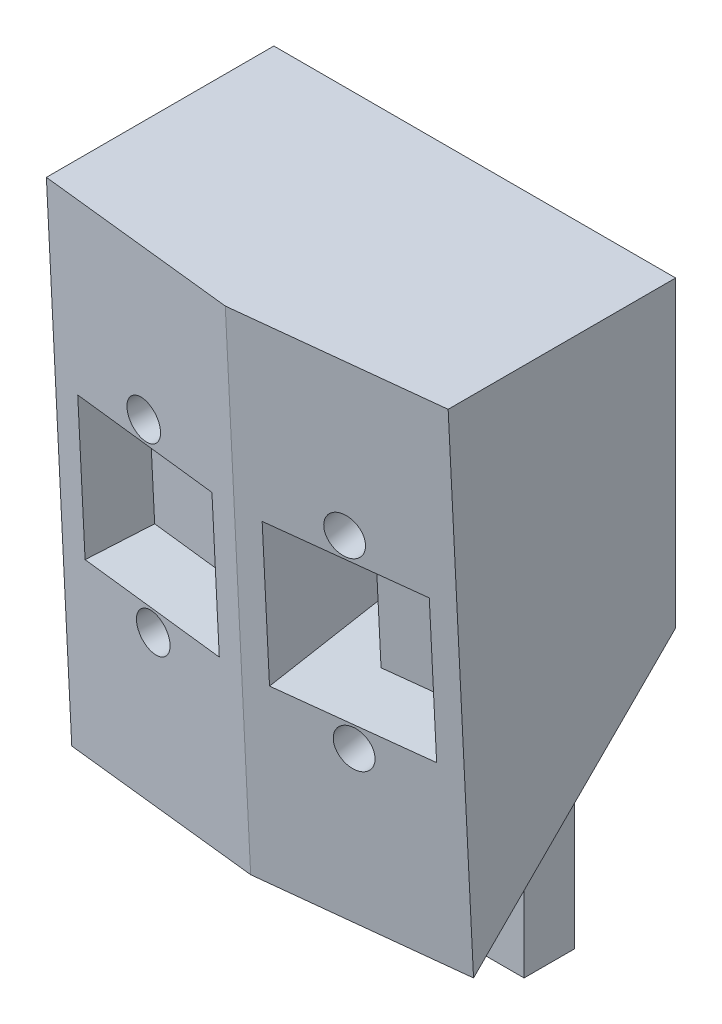
ISO-10303-21;
HEADER;
FILE_DESCRIPTION(('STEP AP214'),'2;1');
FILE_NAME('part.step','',(''),(''),'','','');
FILE_SCHEMA(('AUTOMOTIVE_DESIGN { 1 0 10303 214 1 1 1 1 }'));
ENDSEC;
DATA;
#1=APPLICATION_CONTEXT('core data for automotive mechanical design processes');
#2=APPLICATION_PROTOCOL_DEFINITION('international standard','automotive_design',2000,#1);
#3=PRODUCT_CONTEXT('',#1,'mechanical');
#4=PRODUCT('Part','Part','',(#3));
#5=PRODUCT_RELATED_PRODUCT_CATEGORY('part','',(#4));
#6=PRODUCT_DEFINITION_FORMATION('','',#4);
#7=PRODUCT_DEFINITION_CONTEXT('part definition',#1,'design');
#8=PRODUCT_DEFINITION('design','',#6,#7);
#9=PRODUCT_DEFINITION_SHAPE('','',#8);
#10=(LENGTH_UNIT() NAMED_UNIT(*) SI_UNIT(.MILLI.,.METRE.));
#11=(NAMED_UNIT(*) PLANE_ANGLE_UNIT() SI_UNIT($,.RADIAN.));
#12=(NAMED_UNIT(*) SI_UNIT($,.STERADIAN.) SOLID_ANGLE_UNIT());
#13=UNCERTAINTY_MEASURE_WITH_UNIT(LENGTH_MEASURE(1.E-05),#10,'distance_accuracy_value','');
#14=(GEOMETRIC_REPRESENTATION_CONTEXT(3) GLOBAL_UNCERTAINTY_ASSIGNED_CONTEXT((#13)) GLOBAL_UNIT_ASSIGNED_CONTEXT((#10,
#11,#12)) REPRESENTATION_CONTEXT('',''));
#15=CARTESIAN_POINT('',(0.,0.,0.));
#16=DIRECTION('',(0.,0.,1.));
#17=DIRECTION('',(1.,0.,0.));
#18=AXIS2_PLACEMENT_3D('',#15,#16,#17);
#19=CARTESIAN_POINT('',(20.1992247926776,-50.8,-2.21217489699178));
#20=DIRECTION('',(0.108731274010562,-0.0498956901607081,0.992818175778137));
#21=DIRECTION('',(0.99405633822232,0.,-0.108866874851958));
#22=AXIS2_PLACEMENT_3D('',#19,#20,#21);
#23=PLANE('',#22);
#24=CARTESIAN_POINT('',(10.0996123963388,-34.912993957209,-0.307660152912678));
#25=DIRECTION('',(0.108731274010562,-0.0498956901607081,0.992818175778137));
#26=DIRECTION('',(0.99405633822232,0.,-0.108866874851958));
#27=AXIS2_PLACEMENT_3D('',#24,#25,#26);
#28=CIRCLE('',#27,1.905);
#29=CARTESIAN_POINT('',(11.9932897206523,-34.912993957209,-0.515051549505657));
#30=VERTEX_POINT('',#29);
#31=EDGE_CURVE('E245',#30,#30,#28,.T.);
#32=ORIENTED_EDGE('',*,*,#31,.F.);
#33=EDGE_LOOP('',(#32));
#34=FACE_BOUND('',#33,.T.);
#35=CARTESIAN_POINT('',(10.0996123963388,-15.8870060427909,0.648521775601215));
#36=DIRECTION('',(0.108731274010562,-0.0498956901607081,0.992818175778137));
#37=DIRECTION('',(0.99405633822232,0.,-0.108866874851958));
#38=AXIS2_PLACEMENT_3D('',#35,#36,#37);
#39=CIRCLE('',#38,1.905);
#40=CARTESIAN_POINT('',(11.9932897206523,-15.8870060427909,0.441130379008236));
#41=VERTEX_POINT('',#40);
#42=EDGE_CURVE('E236',#41,#41,#39,.T.);
#43=ORIENTED_EDGE('',*,*,#42,.F.);
#44=EDGE_LOOP('',(#43));
#45=FACE_BOUND('',#44,.T.);
#46=DIRECTION('',(0.99405633822232,0.,-0.108866874851958));
#47=VECTOR('',#46,1.);
#48=CARTESIAN_POINT('',(20.4755139120223,0.,0.310603042946016));
#49=LINE('',#48,#47);
#50=CARTESIAN_POINT('',(0.,0.,2.55303651968032));
#51=VERTEX_POINT('',#50);
#52=CARTESIAN_POINT('',(20.1992247926776,0.,0.340861622688538));
#53=VERTEX_POINT('',#52);
#54=EDGE_CURVE('E393',#51,#53,#49,.T.);
#55=ORIENTED_EDGE('',*,*,#54,.F.);
#56=DIRECTION('',(0.,0.998739523066567,0.0501932770873434));
#57=VECTOR('',#56,1.);
#58=CARTESIAN_POINT('',(0.,-50.9108963488659,-0.00557327615263508));
#59=LINE('',#58,#57);
#60=CARTESIAN_POINT('',(0.,-50.8,0.));
#61=VERTEX_POINT('',#60);
#62=EDGE_CURVE('E405',#61,#51,#59,.T.);
#63=ORIENTED_EDGE('',*,*,#62,.F.);
#64=DIRECTION('',(0.994056338222321,0.,-0.108866874851958));
#65=VECTOR('',#64,1.);
#66=CARTESIAN_POINT('',(20.1992247926776,-50.8,-2.21217489699178));
#67=LINE('',#66,#65);
#68=CARTESIAN_POINT('',(20.1992247926776,-50.8,-2.21217489699178));
#69=VERTEX_POINT('',#68);
#70=EDGE_CURVE('E379',#61,#69,#67,.T.);
#71=ORIENTED_EDGE('',*,*,#70,.T.);
#72=DIRECTION('',(0.,0.998739523066567,0.0501932770873434));
#73=VECTOR('',#72,1.);
#74=CARTESIAN_POINT('',(20.1992247926776,-50.8,-2.21217489699178));
#75=LINE('',#74,#73);
#76=EDGE_CURVE('E404',#69,#53,#75,.T.);
#77=ORIENTED_EDGE('',*,*,#76,.T.);
#78=EDGE_LOOP('',(#55,#63,#71,#77));
#79=FACE_BOUND('',#78,.T.);
#80=DIRECTION('',(-0.994071179570175,-0.00545757896447216,0.108594220747729));
#81=VECTOR('',#80,1.);
#82=CARTESIAN_POINT('',(20.1992247926775,-17.9878364986587,-0.56314632004993));
#83=LINE('',#82,#81);
#84=CARTESIAN_POINT('',(17.6744347846635,-18.0016979213824,-0.287333471728055));
#85=VERTEX_POINT('',#84);
#86=CARTESIAN_POINT('',(2.52479000801404,-18.0848714248009,1.36764245246734));
#87=VERTEX_POINT('',#86);
#88=EDGE_CURVE('E233',#85,#87,#83,.T.);
#89=ORIENTED_EDGE('',*,*,#88,.F.);
#90=DIRECTION('',(0.,-0.998739523066567,-0.0501932770873434));
#91=VECTOR('',#90,1.);
#92=CARTESIAN_POINT('',(17.6744347846635,-32.7151285751991,-1.0267808297788));
#93=LINE('',#92,#91);
#94=CARTESIAN_POINT('',(17.6744347846635,-32.7151285751991,-1.0267808297788));
#95=VERTEX_POINT('',#94);
#96=EDGE_CURVE('E207',#85,#95,#93,.T.);
#97=ORIENTED_EDGE('',*,*,#96,.T.);
#98=DIRECTION('',(0.994071179570175,0.00545757896447216,-0.108594220747729));
#99=VECTOR('',#98,1.);
#100=CARTESIAN_POINT('',(20.1992247926775,-32.7012671524754,-1.30259367810067));
#101=LINE('',#100,#99);
#102=CARTESIAN_POINT('',(2.52479000801404,-32.7983020786176,0.628195094416591));
#103=VERTEX_POINT('',#102);
#104=EDGE_CURVE('E202',#103,#95,#101,.T.);
#105=ORIENTED_EDGE('',*,*,#104,.F.);
#106=DIRECTION('',(0.,-0.998739523066567,-0.0501932770873434));
#107=VECTOR('',#106,1.);
#108=CARTESIAN_POINT('',(2.52479000801404,-50.8970349261422,-0.281386124474511));
#109=LINE('',#108,#107);
#110=EDGE_CURVE('E230',#87,#103,#109,.T.);
#111=ORIENTED_EDGE('',*,*,#110,.F.);
#112=EDGE_LOOP('',(#89,#97,#105,#111));
#113=FACE_BOUND('',#112,.T.);
#114=ADVANCED_FACE('F39',(#34,#45,#79,#113),#23,.T.);
#115=CARTESIAN_POINT('',(-20.1992247926776,-50.8,-22.5321748969918));
#116=DIRECTION('',(0.,0.,-1.));
#117=DIRECTION('',(-1.,0.,0.));
#118=AXIS2_PLACEMENT_3D('',#115,#116,#117);
#119=PLANE('',#118);
#120=CARTESIAN_POINT('',(7.66563217584546,-33.7960648671734,-22.5321748969918));
#121=DIRECTION('',(0.,0.,-1.));
#122=DIRECTION('',(-0.908873107259609,0.417072745333788,0.));
#123=AXIS2_PLACEMENT_3D('',#120,#121,#122);
#124=ELLIPSE('',#123,1.91878034314483,1.905);
#125=CARTESIAN_POINT('',(5.92170432322276,-32.9957938817655,-22.5321748969918));
#126=VERTEX_POINT('',#125);
#127=EDGE_CURVE('E246',#126,#126,#124,.T.);
#128=ORIENTED_EDGE('',*,*,#127,.F.);
#129=EDGE_LOOP('',(#128));
#130=FACE_BOUND('',#129,.T.);
#131=DIRECTION('',(0.00549004621463759,-0.999984929582722,0.));
#132=VECTOR('',#131,1.);
#133=CARTESIAN_POINT('',(5.20307128901493,-50.6605381188049,-22.5321748969918));
#134=LINE('',#133,#132);
#135=CARTESIAN_POINT('',(5.01763235169088,-16.8837472809651,-22.5321748969918));
#136=VERTEX_POINT('',#135);
#137=CARTESIAN_POINT('',(5.09861500819954,-31.6343400629213,-22.5321748969918));
#138=VERTEX_POINT('',#137);
#139=EDGE_CURVE('E241',#136,#138,#134,.T.);
#140=ORIENTED_EDGE('',*,*,#139,.F.);
#141=DIRECTION('',(-1.,0.,0.));
#142=VECTOR('',#141,1.);
#143=CARTESIAN_POINT('',(-20.1992247926775,-16.8837472809652,-22.5321748969918));
#144=LINE('',#143,#142);
#145=CARTESIAN_POINT('',(-5.01763235169088,-16.8837472809651,-22.5321748969918));
#146=VERTEX_POINT('',#145);
#147=EDGE_CURVE('E300',#136,#146,#144,.T.);
#148=ORIENTED_EDGE('',*,*,#147,.T.);
#149=DIRECTION('',(-0.00549004621463759,-0.999984929582722,0.));
#150=VECTOR('',#149,1.);
#151=CARTESIAN_POINT('',(-5.20428892282502,-50.88232413157,-22.5321748969918));
#152=LINE('',#151,#150);
#153=CARTESIAN_POINT('',(-5.09861500819954,-31.6343400629213,-22.5321748969918));
#154=VERTEX_POINT('',#153);
#155=EDGE_CURVE('E296',#146,#154,#152,.T.);
#156=ORIENTED_EDGE('',*,*,#155,.T.);
#157=DIRECTION('',(1.,0.,0.));
#158=VECTOR('',#157,1.);
#159=CARTESIAN_POINT('',(-20.1992247926775,-31.6343400629213,-22.5321748969918));
#160=LINE('',#159,#158);
#161=EDGE_CURVE('E292',#154,#138,#160,.T.);
#162=ORIENTED_EDGE('',*,*,#161,.T.);
#163=EDGE_LOOP('',(#140,#148,#156,#162));
#164=FACE_BOUND('',#163,.T.);
#165=CARTESIAN_POINT('',(7.56091322346357,-14.722022476713,-22.5321748969918));
#166=DIRECTION('',(0.,0.,-1.));
#167=DIRECTION('',(-0.908873107259609,0.417072745333788,0.));
#168=AXIS2_PLACEMENT_3D('',#165,#166,#167);
#169=ELLIPSE('',#168,1.91878034314483,1.905);
#170=CARTESIAN_POINT('',(5.81698537084086,-13.921751491305,-22.5321748969918));
#171=VERTEX_POINT('',#170);
#172=EDGE_CURVE('E237',#171,#171,#169,.T.);
#173=ORIENTED_EDGE('',*,*,#172,.F.);
#174=EDGE_LOOP('',(#173));
#175=FACE_BOUND('',#174,.T.);
#176=CARTESIAN_POINT('',(-7.66563217584546,-33.7960648671734,-22.5321748969918));
#177=DIRECTION('',(0.,0.,-1.));
#178=DIRECTION('',(0.908873107259609,0.417072745333788,0.));
#179=AXIS2_PLACEMENT_3D('',#176,#177,#178);
#180=ELLIPSE('',#179,1.91878034314483,1.905);
#181=CARTESIAN_POINT('',(-5.92170432322276,-32.9957938817655,-22.5321748969918));
#182=VERTEX_POINT('',#181);
#183=EDGE_CURVE('E304',#182,#182,#180,.F.);
#184=ORIENTED_EDGE('',*,*,#183,.T.);
#185=EDGE_LOOP('',(#184));
#186=FACE_BOUND('',#185,.T.);
#187=CARTESIAN_POINT('',(-7.56091322346357,-14.722022476713,-22.5321748969918));
#188=DIRECTION('',(0.,0.,-1.));
#189=DIRECTION('',(0.908873107259609,0.417072745333788,0.));
#190=AXIS2_PLACEMENT_3D('',#187,#188,#189);
#191=ELLIPSE('',#190,1.91878034314483,1.905);
#192=CARTESIAN_POINT('',(-5.81698537084086,-13.921751491305,-22.5321748969918));
#193=VERTEX_POINT('',#192);
#194=EDGE_CURVE('E288',#193,#193,#191,.F.);
#195=ORIENTED_EDGE('',*,*,#194,.T.);
#196=EDGE_LOOP('',(#195));
#197=FACE_BOUND('',#196,.T.);
#198=DIRECTION('',(0.,1.,0.));
#199=VECTOR('',#198,1.);
#200=CARTESIAN_POINT('',(20.1992247926776,-50.8,-22.5321748969918));
#201=LINE('',#200,#199);
#202=CARTESIAN_POINT('',(20.1992247926776,-30.4800000000002,-22.5321748969918));
#203=VERTEX_POINT('',#202);
#204=CARTESIAN_POINT('',(20.1992247926776,0.,-22.5321748969918));
#205=VERTEX_POINT('',#204);
#206=EDGE_CURVE('E401',#203,#205,#201,.T.);
#207=ORIENTED_EDGE('',*,*,#206,.F.);
#208=DIRECTION('',(1.,0.,0.));
#209=VECTOR('',#208,1.);
#210=CARTESIAN_POINT('',(10.0392247926775,-30.4800000000002,-22.5321748969918));
#211=LINE('',#210,#209);
#212=CARTESIAN_POINT('',(10.0392247926775,-30.4800000000002,-22.5321748969918));
#213=VERTEX_POINT('',#212);
#214=EDGE_CURVE('E344',#213,#203,#211,.T.);
#215=ORIENTED_EDGE('',*,*,#214,.F.);
#216=DIRECTION('',(0.,-1.,0.));
#217=VECTOR('',#216,1.);
#218=CARTESIAN_POINT('',(10.0392247926775,-50.8,-22.5321748969918));
#219=LINE('',#218,#217);
#220=CARTESIAN_POINT('',(10.0392247926775,-63.5,-22.5321748969918));
#221=VERTEX_POINT('',#220);
#222=EDGE_CURVE('E335',#213,#221,#219,.T.);
#223=ORIENTED_EDGE('',*,*,#222,.T.);
#224=DIRECTION('',(1.,0.,0.));
#225=VECTOR('',#224,1.);
#226=CARTESIAN_POINT('',(-10.0392247926775,-63.5,-22.5321748969918));
#227=LINE('',#226,#225);
#228=CARTESIAN_POINT('',(-10.0392247926775,-63.5,-22.5321748969918));
#229=VERTEX_POINT('',#228);
#230=EDGE_CURVE('E313',#229,#221,#227,.T.);
#231=ORIENTED_EDGE('',*,*,#230,.F.);
#232=DIRECTION('',(0.,-1.,0.));
#233=VECTOR('',#232,1.);
#234=CARTESIAN_POINT('',(-10.0392247926775,-50.8,-22.5321748969918));
#235=LINE('',#234,#233);
#236=CARTESIAN_POINT('',(-10.0392247926775,-30.4800000000002,-22.5321748969918));
#237=VERTEX_POINT('',#236);
#238=EDGE_CURVE('E355',#237,#229,#235,.T.);
#239=ORIENTED_EDGE('',*,*,#238,.F.);
#240=DIRECTION('',(-1.,0.,0.));
#241=VECTOR('',#240,1.);
#242=CARTESIAN_POINT('',(-10.0392247926775,-30.4800000000002,-22.5321748969918));
#243=LINE('',#242,#241);
#244=CARTESIAN_POINT('',(-20.1992247926776,-30.4800000000002,-22.5321748969918));
#245=VERTEX_POINT('',#244);
#246=EDGE_CURVE('E368',#237,#245,#243,.T.);
#247=ORIENTED_EDGE('',*,*,#246,.T.);
#248=DIRECTION('',(0.,1.,0.));
#249=VECTOR('',#248,1.);
#250=CARTESIAN_POINT('',(-20.1992247926776,-50.8,-22.5321748969918));
#251=LINE('',#250,#249);
#252=CARTESIAN_POINT('',(-20.1992247926776,0.,-22.5321748969918));
#253=VERTEX_POINT('',#252);
#254=EDGE_CURVE('E397',#245,#253,#251,.T.);
#255=ORIENTED_EDGE('',*,*,#254,.T.);
#256=DIRECTION('',(-1.,0.,0.));
#257=VECTOR('',#256,1.);
#258=CARTESIAN_POINT('',(-20.1992247926776,0.,-22.5321748969918));
#259=LINE('',#258,#257);
#260=EDGE_CURVE('E380',#205,#253,#259,.T.);
#261=ORIENTED_EDGE('',*,*,#260,.F.);
#262=EDGE_LOOP('',(#207,#215,#223,#231,#239,#247,#255,#261));
#263=FACE_BOUND('',#262,.T.);
#264=ADVANCED_FACE('F447',(#130,#164,#175,#186,#197,#263),#119,.T.);
#265=CARTESIAN_POINT('',(20.1992247926776,-50.8,-2.21217489699178));
#266=DIRECTION('',(1.,0.,0.));
#267=DIRECTION('',(0.,0.,-1.));
#268=AXIS2_PLACEMENT_3D('',#265,#266,#267);
#269=PLANE('',#268);
#270=ORIENTED_EDGE('',*,*,#76,.F.);
#271=DIRECTION('',(0.,0.707106781186543,-0.707106781186551));
#272=VECTOR('',#271,1.);
#273=CARTESIAN_POINT('',(20.1992247926776,-30.4800000000002,-22.5321748969918));
#274=LINE('',#273,#272);
#275=EDGE_CURVE('E334',#69,#203,#274,.T.);
#276=ORIENTED_EDGE('',*,*,#275,.T.);
#277=ORIENTED_EDGE('',*,*,#206,.T.);
#278=DIRECTION('',(0.,0.,-1.));
#279=VECTOR('',#278,1.);
#280=CARTESIAN_POINT('',(20.1992247926776,0.,-2.21217489699178));
#281=LINE('',#280,#279);
#282=EDGE_CURVE('E389',#53,#205,#281,.T.);
#283=ORIENTED_EDGE('',*,*,#282,.F.);
#284=EDGE_LOOP('',(#270,#276,#277,#283));
#285=FACE_BOUND('',#284,.T.);
#286=ADVANCED_FACE('F548',(#285),#269,.T.);
#287=CARTESIAN_POINT('',(0.,-50.8,0.));
#288=DIRECTION('',(0.,-1.,0.));
#289=DIRECTION('',(0.,0.,-1.));
#290=AXIS2_PLACEMENT_3D('',#287,#288,#289);
#291=PLANE('',#290);
#292=DIRECTION('',(-1.,0.,0.));
#293=VECTOR('',#292,1.);
#294=CARTESIAN_POINT('',(-10.0392247926775,-50.8,-17.4521748969918));
#295=LINE('',#294,#293);
#296=CARTESIAN_POINT('',(10.0392247926775,-50.8,-17.4521748969918));
#297=VERTEX_POINT('',#296);
#298=CARTESIAN_POINT('',(-10.0392247926775,-50.8,-17.4521748969918));
#299=VERTEX_POINT('',#298);
#300=EDGE_CURVE('E308',#297,#299,#295,.T.);
#301=ORIENTED_EDGE('',*,*,#300,.F.);
#302=DIRECTION('',(0.,0.,1.));
#303=VECTOR('',#302,1.);
#304=CARTESIAN_POINT('',(10.0392247926775,-50.8,-2.21217489699178));
#305=LINE('',#304,#303);
#306=CARTESIAN_POINT('',(10.0392247926775,-50.8,-2.21217489699178));
#307=VERTEX_POINT('',#306);
#308=EDGE_CURVE('E341',#297,#307,#305,.T.);
#309=ORIENTED_EDGE('',*,*,#308,.T.);
#310=DIRECTION('',(1.,0.,0.));
#311=VECTOR('',#310,1.);
#312=CARTESIAN_POINT('',(10.0392247926775,-50.8,-2.21217489699178));
#313=LINE('',#312,#311);
#314=EDGE_CURVE('E348',#307,#69,#313,.T.);
#315=ORIENTED_EDGE('',*,*,#314,.T.);
#316=ORIENTED_EDGE('',*,*,#70,.F.);
#317=DIRECTION('',(0.994056338222321,0.,0.108866874851958));
#318=VECTOR('',#317,1.);
#319=CARTESIAN_POINT('',(-20.1992247926776,-50.8,-2.21217489699178));
#320=LINE('',#319,#318);
#321=CARTESIAN_POINT('',(-20.1992247926776,-50.8,-2.21217489699178));
#322=VERTEX_POINT('',#321);
#323=EDGE_CURVE('E375',#322,#61,#320,.T.);
#324=ORIENTED_EDGE('',*,*,#323,.F.);
#325=DIRECTION('',(-1.,0.,0.));
#326=VECTOR('',#325,1.);
#327=CARTESIAN_POINT('',(-10.0392247926775,-50.8,-2.21217489699178));
#328=LINE('',#327,#326);
#329=CARTESIAN_POINT('',(-10.0392247926775,-50.8,-2.21217489699178));
#330=VERTEX_POINT('',#329);
#331=EDGE_CURVE('E365',#330,#322,#328,.T.);
#332=ORIENTED_EDGE('',*,*,#331,.F.);
#333=DIRECTION('',(0.,0.,1.));
#334=VECTOR('',#333,1.);
#335=CARTESIAN_POINT('',(-10.0392247926775,-50.8,-2.21217489699178));
#336=LINE('',#335,#334);
#337=EDGE_CURVE('E358',#299,#330,#336,.T.);
#338=ORIENTED_EDGE('',*,*,#337,.F.);
#339=EDGE_LOOP('',(#301,#309,#315,#316,#324,#332,#338));
#340=FACE_BOUND('',#339,.T.);
#341=ADVANCED_FACE('F544',(#340),#291,.T.);
#342=CARTESIAN_POINT('',(-20.1992247926776,-50.8,-2.21217489699178));
#343=DIRECTION('',(-1.,0.,0.));
#344=DIRECTION('',(0.,0.,1.));
#345=AXIS2_PLACEMENT_3D('',#342,#343,#344);
#346=PLANE('',#345);
#347=DIRECTION('',(0.,0.707106781186543,-0.707106781186551));
#348=VECTOR('',#347,1.);
#349=CARTESIAN_POINT('',(-20.1992247926776,-30.4800000000002,-22.5321748969918));
#350=LINE('',#349,#348);
#351=EDGE_CURVE('E352',#322,#245,#350,.T.);
#352=ORIENTED_EDGE('',*,*,#351,.F.);
#353=DIRECTION('',(0.,0.998739523066567,0.0501932770873434));
#354=VECTOR('',#353,1.);
#355=CARTESIAN_POINT('',(-20.1992247926776,-50.8,-2.21217489699178));
#356=LINE('',#355,#354);
#357=CARTESIAN_POINT('',(-20.1992247926776,0.,0.340861622688538));
#358=VERTEX_POINT('',#357);
#359=EDGE_CURVE('E384',#322,#358,#356,.T.);
#360=ORIENTED_EDGE('',*,*,#359,.T.);
#361=DIRECTION('',(0.,0.,1.));
#362=VECTOR('',#361,1.);
#363=CARTESIAN_POINT('',(-20.1992247926776,0.,-2.21217489699178));
#364=LINE('',#363,#362);
#365=EDGE_CURVE('E372',#253,#358,#364,.T.);
#366=ORIENTED_EDGE('',*,*,#365,.F.);
#367=ORIENTED_EDGE('',*,*,#254,.F.);
#368=EDGE_LOOP('',(#352,#360,#366,#367));
#369=FACE_BOUND('',#368,.T.);
#370=ADVANCED_FACE('F547',(#369),#346,.T.);
#371=CARTESIAN_POINT('',(-20.1992247926776,-50.8,-2.21217489699178));
#372=DIRECTION('',(-0.108731274010562,-0.0498956901607081,0.992818175778137));
#373=DIRECTION('',(0.99405633822232,0.,0.108866874851958));
#374=AXIS2_PLACEMENT_3D('',#371,#372,#373);
#375=PLANE('',#374);
#376=DIRECTION('',(-0.994071179570175,0.00545757896447216,-0.108594220747729));
#377=VECTOR('',#376,1.);
#378=CARTESIAN_POINT('',(-20.1992247926775,-32.7012671524754,-1.30259367810067));
#379=LINE('',#378,#377);
#380=CARTESIAN_POINT('',(-2.52479000801404,-32.7983020786176,0.628195094416592));
#381=VERTEX_POINT('',#380);
#382=CARTESIAN_POINT('',(-17.6744347846635,-32.7151285751991,-1.0267808297788));
#383=VERTEX_POINT('',#382);
#384=EDGE_CURVE('E424',#381,#383,#379,.T.);
#385=ORIENTED_EDGE('',*,*,#384,.T.);
#386=DIRECTION('',(0.,-0.998739523066567,-0.0501932770873434));
#387=VECTOR('',#386,1.);
#388=CARTESIAN_POINT('',(-17.6744347846635,-32.7151285751991,-1.0267808297788));
#389=LINE('',#388,#387);
#390=CARTESIAN_POINT('',(-17.6744347846635,-18.0016979213824,-0.287333471728055));
#391=VERTEX_POINT('',#390);
#392=EDGE_CURVE('E250',#391,#383,#389,.T.);
#393=ORIENTED_EDGE('',*,*,#392,.F.);
#394=DIRECTION('',(0.994071179570175,-0.00545757896447216,0.108594220747729));
#395=VECTOR('',#394,1.);
#396=CARTESIAN_POINT('',(-20.1992247926775,-17.9878364986587,-0.56314632004993));
#397=LINE('',#396,#395);
#398=CARTESIAN_POINT('',(-2.52479000801404,-18.0848714248009,1.36764245246734));
#399=VERTEX_POINT('',#398);
#400=EDGE_CURVE('E427',#391,#399,#397,.T.);
#401=ORIENTED_EDGE('',*,*,#400,.T.);
#402=DIRECTION('',(0.,-0.998739523066567,-0.0501932770873434));
#403=VECTOR('',#402,1.);
#404=CARTESIAN_POINT('',(-2.52479000801404,-50.8970349261422,-0.281386124474511));
#405=LINE('',#404,#403);
#406=EDGE_CURVE('E400',#399,#381,#405,.T.);
#407=ORIENTED_EDGE('',*,*,#406,.T.);
#408=EDGE_LOOP('',(#385,#393,#401,#407));
#409=FACE_BOUND('',#408,.T.);
#410=CARTESIAN_POINT('',(-10.0996123963388,-34.912993957209,-0.307660152912678));
#411=DIRECTION('',(-0.108731274010562,-0.0498956901607081,0.992818175778137));
#412=DIRECTION('',(0.99405633822232,0.,0.108866874851958));
#413=AXIS2_PLACEMENT_3D('',#410,#411,#412);
#414=CIRCLE('',#413,1.905);
#415=CARTESIAN_POINT('',(-8.20593507202526,-34.912993957209,-0.100268756319699));
#416=VERTEX_POINT('',#415);
#417=EDGE_CURVE('E303',#416,#416,#414,.F.);
#418=ORIENTED_EDGE('',*,*,#417,.T.);
#419=EDGE_LOOP('',(#418));
#420=FACE_BOUND('',#419,.T.);
#421=CARTESIAN_POINT('',(-10.0996123963388,-15.8870060427909,0.648521775601215));
#422=DIRECTION('',(-0.108731274010562,-0.0498956901607081,0.992818175778137));
#423=DIRECTION('',(0.99405633822232,0.,0.108866874851958));
#424=AXIS2_PLACEMENT_3D('',#421,#422,#423);
#425=CIRCLE('',#424,1.905);
#426=CARTESIAN_POINT('',(-8.20593507202526,-15.8870060427909,0.855913172194194));
#427=VERTEX_POINT('',#426);
#428=EDGE_CURVE('E287',#427,#427,#425,.F.);
#429=ORIENTED_EDGE('',*,*,#428,.T.);
#430=EDGE_LOOP('',(#429));
#431=FACE_BOUND('',#430,.T.);
#432=DIRECTION('',(0.99405633822232,0.,0.108866874851958));
#433=VECTOR('',#432,1.);
#434=CARTESIAN_POINT('',(-20.4755139120223,0.,0.310603042946016));
#435=LINE('',#434,#433);
#436=EDGE_CURVE('E388',#358,#51,#435,.T.);
#437=ORIENTED_EDGE('',*,*,#436,.F.);
#438=ORIENTED_EDGE('',*,*,#359,.F.);
#439=ORIENTED_EDGE('',*,*,#323,.T.);
#440=ORIENTED_EDGE('',*,*,#62,.T.);
#441=EDGE_LOOP('',(#437,#438,#439,#440));
#442=FACE_BOUND('',#441,.T.);
#443=ADVANCED_FACE('F41',(#409,#420,#431,#442),#375,.T.);
#444=CARTESIAN_POINT('',(0.,0.,0.));
#445=DIRECTION('',(0.,-1.,0.));
#446=DIRECTION('',(0.,0.,-1.));
#447=AXIS2_PLACEMENT_3D('',#444,#445,#446);
#448=PLANE('',#447);
#449=ORIENTED_EDGE('',*,*,#365,.T.);
#450=ORIENTED_EDGE('',*,*,#436,.T.);
#451=ORIENTED_EDGE('',*,*,#54,.T.);
#452=ORIENTED_EDGE('',*,*,#282,.T.);
#453=ORIENTED_EDGE('',*,*,#260,.T.);
#454=EDGE_LOOP('',(#449,#450,#451,#452,#453));
#455=FACE_BOUND('',#454,.T.);
#456=ADVANCED_FACE('F542',(#455),#448,.F.);
#457=CARTESIAN_POINT('',(-10.0392247926775,-30.4800000000002,-22.5321748969918));
#458=DIRECTION('',(0.,0.707106781186552,0.707106781186544));
#459=DIRECTION('',(0.,-0.707106781186544,0.707106781186551));
#460=AXIS2_PLACEMENT_3D('',#457,#458,#459);
#461=PLANE('',#460);
#462=ORIENTED_EDGE('',*,*,#351,.T.);
#463=ORIENTED_EDGE('',*,*,#246,.F.);
#464=DIRECTION('',(0.,0.707106781186543,-0.707106781186551));
#465=VECTOR('',#464,1.);
#466=CARTESIAN_POINT('',(-10.0392247926775,-30.4800000000002,-22.5321748969918));
#467=LINE('',#466,#465);
#468=EDGE_CURVE('E361',#330,#237,#467,.T.);
#469=ORIENTED_EDGE('',*,*,#468,.F.);
#470=ORIENTED_EDGE('',*,*,#331,.T.);
#471=EDGE_LOOP('',(#462,#463,#469,#470));
#472=FACE_BOUND('',#471,.T.);
#473=ADVANCED_FACE('F538',(#472),#461,.F.);
#474=CARTESIAN_POINT('',(-10.0392247926775,0.,0.));
#475=DIRECTION('',(-1.,0.,0.));
#476=DIRECTION('',(0.,0.,1.));
#477=AXIS2_PLACEMENT_3D('',#474,#475,#476);
#478=PLANE('',#477);
#479=ORIENTED_EDGE('',*,*,#238,.T.);
#480=DIRECTION('',(0.,0.,-1.));
#481=VECTOR('',#480,1.);
#482=CARTESIAN_POINT('',(-10.0392247926775,-63.5,-22.5321748969918));
#483=LINE('',#482,#481);
#484=CARTESIAN_POINT('',(-10.0392247926775,-63.5,-17.4521748969918));
#485=VERTEX_POINT('',#484);
#486=EDGE_CURVE('E309',#485,#229,#483,.T.);
#487=ORIENTED_EDGE('',*,*,#486,.F.);
#488=DIRECTION('',(0.,1.,0.));
#489=VECTOR('',#488,1.);
#490=CARTESIAN_POINT('',(-10.0392247926775,-63.5,-17.4521748969918));
#491=LINE('',#490,#489);
#492=EDGE_CURVE('E323',#485,#299,#491,.T.);
#493=ORIENTED_EDGE('',*,*,#492,.T.);
#494=ORIENTED_EDGE('',*,*,#337,.T.);
#495=ORIENTED_EDGE('',*,*,#468,.T.);
#496=EDGE_LOOP('',(#479,#487,#493,#494,#495));
#497=FACE_BOUND('',#496,.T.);
#498=ADVANCED_FACE('F534',(#497),#478,.T.);
#499=CARTESIAN_POINT('',(10.0392247926775,-30.4800000000002,-22.5321748969918));
#500=DIRECTION('',(0.,-0.707106781186552,-0.707106781186544));
#501=DIRECTION('',(0.,0.707106781186544,-0.707106781186551));
#502=AXIS2_PLACEMENT_3D('',#499,#500,#501);
#503=PLANE('',#502);
#504=ORIENTED_EDGE('',*,*,#275,.F.);
#505=ORIENTED_EDGE('',*,*,#314,.F.);
#506=DIRECTION('',(0.,0.707106781186543,-0.707106781186551));
#507=VECTOR('',#506,1.);
#508=CARTESIAN_POINT('',(10.0392247926775,-30.4800000000002,-22.5321748969918));
#509=LINE('',#508,#507);
#510=EDGE_CURVE('E338',#307,#213,#509,.T.);
#511=ORIENTED_EDGE('',*,*,#510,.T.);
#512=ORIENTED_EDGE('',*,*,#214,.T.);
#513=EDGE_LOOP('',(#504,#505,#511,#512));
#514=FACE_BOUND('',#513,.T.);
#515=ADVANCED_FACE('F530',(#514),#503,.T.);
#516=CARTESIAN_POINT('',(10.0392247926775,0.,0.));
#517=DIRECTION('',(1.,0.,0.));
#518=DIRECTION('',(0.,0.,1.));
#519=AXIS2_PLACEMENT_3D('',#516,#517,#518);
#520=PLANE('',#519);
#521=ORIENTED_EDGE('',*,*,#222,.F.);
#522=ORIENTED_EDGE('',*,*,#510,.F.);
#523=ORIENTED_EDGE('',*,*,#308,.F.);
#524=DIRECTION('',(0.,1.,0.));
#525=VECTOR('',#524,1.);
#526=CARTESIAN_POINT('',(10.0392247926775,-63.5,-17.4521748969918));
#527=LINE('',#526,#525);
#528=CARTESIAN_POINT('',(10.0392247926775,-63.5,-17.4521748969918));
#529=VERTEX_POINT('',#528);
#530=EDGE_CURVE('E330',#529,#297,#527,.T.);
#531=ORIENTED_EDGE('',*,*,#530,.F.);
#532=DIRECTION('',(0.,0.,1.));
#533=VECTOR('',#532,1.);
#534=CARTESIAN_POINT('',(10.0392247926775,-63.5,-22.5321748969918));
#535=LINE('',#534,#533);
#536=EDGE_CURVE('E317',#221,#529,#535,.T.);
#537=ORIENTED_EDGE('',*,*,#536,.F.);
#538=EDGE_LOOP('',(#521,#522,#523,#531,#537));
#539=FACE_BOUND('',#538,.T.);
#540=ADVANCED_FACE('F526',(#539),#520,.T.);
#541=CARTESIAN_POINT('',(-10.0392247926775,-63.5,-17.4521748969918));
#542=DIRECTION('',(0.,0.,-1.));
#543=DIRECTION('',(-1.,0.,0.));
#544=AXIS2_PLACEMENT_3D('',#541,#542,#543);
#545=PLANE('',#544);
#546=ORIENTED_EDGE('',*,*,#300,.T.);
#547=ORIENTED_EDGE('',*,*,#492,.F.);
#548=DIRECTION('',(-1.,0.,0.));
#549=VECTOR('',#548,1.);
#550=CARTESIAN_POINT('',(-10.0392247926775,-63.5,-17.4521748969918));
#551=LINE('',#550,#549);
#552=EDGE_CURVE('E320',#529,#485,#551,.T.);
#553=ORIENTED_EDGE('',*,*,#552,.F.);
#554=ORIENTED_EDGE('',*,*,#530,.T.);
#555=EDGE_LOOP('',(#546,#547,#553,#554));
#556=FACE_BOUND('',#555,.T.);
#557=ADVANCED_FACE('F522',(#556),#545,.F.);
#558=CARTESIAN_POINT('',(0.,-63.5,0.));
#559=DIRECTION('',(0.,1.,0.));
#560=DIRECTION('',(0.,0.,1.));
#561=AXIS2_PLACEMENT_3D('',#558,#559,#560);
#562=PLANE('',#561);
#563=ORIENTED_EDGE('',*,*,#486,.T.);
#564=ORIENTED_EDGE('',*,*,#230,.T.);
#565=ORIENTED_EDGE('',*,*,#536,.T.);
#566=ORIENTED_EDGE('',*,*,#552,.T.);
#567=EDGE_LOOP('',(#563,#564,#565,#566));
#568=FACE_BOUND('',#567,.T.);
#569=ADVANCED_FACE('F518',(#568),#562,.F.);
#570=CARTESIAN_POINT('',(-10.6829191227912,-16.1546796441221,5.97465747432747));
#571=DIRECTION('',(0.108731274010562,0.0498956901607081,-0.992818175778136));
#572=DIRECTION('',(-0.99405633822232,0.,-0.108866874851958));
#573=AXIS2_PLACEMENT_3D('',#570,#571,#572);
#574=CYLINDRICAL_SURFACE('',#573,1.905);
#575=ORIENTED_EDGE('',*,*,#194,.F.);
#576=EDGE_LOOP('',(#575));
#577=FACE_BOUND('',#576,.T.);
#578=ORIENTED_EDGE('',*,*,#428,.F.);
#579=EDGE_LOOP('',(#578));
#580=FACE_BOUND('',#579,.T.);
#581=ADVANCED_FACE('F512',(#577,#580),#574,.F.);
#582=CARTESIAN_POINT('',(-3.10809673446649,-18.3525450261321,6.69377815119359));
#583=DIRECTION('',(0.,-0.998739523066567,-0.0501932770873434));
#584=DIRECTION('',(0.,0.0501932770873435,-0.998739523066567));
#585=AXIS2_PLACEMENT_3D('',#582,#583,#584);
#586=PLANE('',#585);
#587=DIRECTION('',(-0.108731274010562,0.0498956901607081,-0.992818175778136));
#588=VECTOR('',#587,1.);
#589=CARTESIAN_POINT('',(8.15797832668298,-18.3248205249925,6.14211950979512));
#590=LINE('',#589,#588);
#591=CARTESIAN_POINT('',(6.88422801026346,-17.7403092911409,-5.48841160512229));
#592=VERTEX_POINT('',#591);
#593=EDGE_CURVE('E215',#592,#136,#590,.T.);
#594=ORIENTED_EDGE('',*,*,#593,.F.);
#595=DIRECTION('',(0.994071179570176,0.00545757896447216,-0.108594220747729));
#596=VECTOR('',#595,1.);
#597=CARTESIAN_POINT('',(16.9839911946964,-17.6848602888619,-6.59172888791922));
#598=LINE('',#597,#596);
#599=CARTESIAN_POINT('',(16.9839911946964,-17.6848602888619,-6.59172888791922));
#600=VERTEX_POINT('',#599);
#601=EDGE_CURVE('E55',#592,#600,#598,.T.);
#602=ORIENTED_EDGE('',*,*,#601,.T.);
#603=DIRECTION('',(0.108731274010562,-0.0498956901607081,0.992818175778136));
#604=VECTOR('',#603,1.);
#605=CARTESIAN_POINT('',(16.9839911946964,-17.6848602888619,-6.59172888791922));
#606=LINE('',#605,#604);
#607=EDGE_CURVE('E190',#600,#85,#606,.T.);
#608=ORIENTED_EDGE('',*,*,#607,.T.);
#609=ORIENTED_EDGE('',*,*,#88,.T.);
#610=DIRECTION('',(-0.108731274010562,0.0498956901607081,-0.992818175778136));
#611=VECTOR('',#610,1.);
#612=CARTESIAN_POINT('',(3.10809673446649,-18.3525450261321,6.69377815119359));
#613=LINE('',#612,#611);
#614=CARTESIAN_POINT('',(0.,-16.9262706348527,-21.6860505423914));
#615=VERTEX_POINT('',#614);
#616=EDGE_CURVE('E225',#87,#615,#613,.T.);
#617=ORIENTED_EDGE('',*,*,#616,.T.);
#618=DIRECTION('',(0.108731274010562,0.0498956901607081,-0.992818175778136));
#619=VECTOR('',#618,1.);
#620=CARTESIAN_POINT('',(-3.10809673446649,-18.3525450261321,6.69377815119359));
#621=LINE('',#620,#619);
#622=EDGE_CURVE('E273',#399,#615,#621,.T.);
#623=ORIENTED_EDGE('',*,*,#622,.F.);
#624=ORIENTED_EDGE('',*,*,#400,.F.);
#625=DIRECTION('',(-0.108731274010562,-0.0498956901607081,0.992818175778136));
#626=VECTOR('',#625,1.);
#627=CARTESIAN_POINT('',(-16.9839911946964,-17.6848602888619,-6.59172888791922));
#628=LINE('',#627,#626);
#629=CARTESIAN_POINT('',(-16.9839911946964,-17.6848602888619,-6.59172888791922));
#630=VERTEX_POINT('',#629);
#631=EDGE_CURVE('E259',#630,#391,#628,.T.);
#632=ORIENTED_EDGE('',*,*,#631,.F.);
#633=DIRECTION('',(-0.994071179570176,0.00545757896447216,-0.108594220747729));
#634=VECTOR('',#633,1.);
#635=CARTESIAN_POINT('',(-16.9839911946964,-17.6848602888619,-6.59172888791922));
#636=LINE('',#635,#634);
#637=CARTESIAN_POINT('',(-6.88422801026346,-17.7403092911409,-5.48841160512229));
#638=VERTEX_POINT('',#637);
#639=EDGE_CURVE('E251',#638,#630,#636,.T.);
#640=ORIENTED_EDGE('',*,*,#639,.F.);
#641=DIRECTION('',(0.108731274010562,0.0498956901607081,-0.992818175778136));
#642=VECTOR('',#641,1.);
#643=CARTESIAN_POINT('',(-8.15797832668298,-18.3248205249925,6.14211950979512));
#644=LINE('',#643,#642);
#645=EDGE_CURVE('E283',#638,#146,#644,.T.);
#646=ORIENTED_EDGE('',*,*,#645,.T.);
#647=ORIENTED_EDGE('',*,*,#147,.F.);
#648=EDGE_LOOP('',(#594,#602,#608,#609,#617,#623,#624,#632,#640,#646,#647));
#649=FACE_BOUND('',#648,.T.);
#650=ADVANCED_FACE('F456',(#649),#586,.T.);
#651=CARTESIAN_POINT('',(-8.15797832668298,-18.3248205249925,6.14211950979512));
#652=DIRECTION('',(0.994071179570175,-0.00545757896447188,0.108594220747729));
#653=DIRECTION('',(0.10859583803242,0.,-0.994085984189515));
#654=AXIS2_PLACEMENT_3D('',#651,#652,#653);
#655=PLANE('',#654);
#656=DIRECTION('',(0.,0.998739523066567,0.0501932770873434));
#657=VECTOR('',#656,1.);
#658=CARTESIAN_POINT('',(-6.88422801026346,-17.7403092911409,-5.48841160512229));
#659=LINE('',#658,#657);
#660=CARTESIAN_POINT('',(-6.88422801026346,-32.4537399449576,-6.22785896317304));
#661=VERTEX_POINT('',#660);
#662=EDGE_CURVE('E267',#661,#638,#659,.T.);
#663=ORIENTED_EDGE('',*,*,#662,.F.);
#664=DIRECTION('',(0.108731274010562,0.0498956901607081,-0.992818175778136));
#665=VECTOR('',#664,1.);
#666=CARTESIAN_POINT('',(-8.15797832668298,-33.0382511788092,5.40267215174438));
#667=LINE('',#666,#665);
#668=EDGE_CURVE('E280',#661,#154,#667,.T.);
#669=ORIENTED_EDGE('',*,*,#668,.T.);
#670=ORIENTED_EDGE('',*,*,#155,.F.);
#671=ORIENTED_EDGE('',*,*,#645,.F.);
#672=EDGE_LOOP('',(#663,#669,#670,#671));
#673=FACE_BOUND('',#672,.T.);
#674=ADVANCED_FACE('F468',(#673),#655,.T.);
#675=CARTESIAN_POINT('',(-8.15797832668298,-33.0382511788092,5.40267215174438));
#676=DIRECTION('',(0.,0.998739523066567,0.0501932770873434));
#677=DIRECTION('',(0.,-0.0501932770873435,0.998739523066567));
#678=AXIS2_PLACEMENT_3D('',#675,#676,#677);
#679=PLANE('',#678);
#680=DIRECTION('',(0.108731274010562,0.0498956901607081,-0.992818175778136));
#681=VECTOR('',#680,1.);
#682=CARTESIAN_POINT('',(-3.10809673446649,-33.0659756799487,5.95433079314284));
#683=LINE('',#682,#681);
#684=CARTESIAN_POINT('',(0.,-31.6397012886693,-22.4254979004422));
#685=VERTEX_POINT('',#684);
#686=EDGE_CURVE('E277',#381,#685,#683,.T.);
#687=ORIENTED_EDGE('',*,*,#686,.T.);
#688=DIRECTION('',(-0.108731274010562,0.0498956901607081,-0.992818175778136));
#689=VECTOR('',#688,1.);
#690=CARTESIAN_POINT('',(3.10809673446649,-33.0659756799487,5.95433079314284));
#691=LINE('',#690,#689);
#692=EDGE_CURVE('E222',#103,#685,#691,.T.);
#693=ORIENTED_EDGE('',*,*,#692,.F.);
#694=ORIENTED_EDGE('',*,*,#104,.T.);
#695=DIRECTION('',(0.108731274010562,-0.0498956901607081,0.992818175778136));
#696=VECTOR('',#695,1.);
#697=CARTESIAN_POINT('',(16.9839911946964,-32.3982909426786,-7.33117624596996));
#698=LINE('',#697,#696);
#699=CARTESIAN_POINT('',(16.9839911946964,-32.3982909426786,-7.33117624596996));
#700=VERTEX_POINT('',#699);
#701=EDGE_CURVE('E187',#700,#95,#698,.T.);
#702=ORIENTED_EDGE('',*,*,#701,.F.);
#703=DIRECTION('',(-0.994071179570176,-0.00545757896447216,0.108594220747729));
#704=VECTOR('',#703,1.);
#705=CARTESIAN_POINT('',(16.9839911946964,-32.3982909426786,-7.33117624596996));
#706=LINE('',#705,#704);
#707=CARTESIAN_POINT('',(6.88422801026346,-32.4537399449576,-6.22785896317304));
#708=VERTEX_POINT('',#707);
#709=EDGE_CURVE('E193',#700,#708,#706,.T.);
#710=ORIENTED_EDGE('',*,*,#709,.T.);
#711=DIRECTION('',(-0.108731274010562,0.0498956901607081,-0.992818175778136));
#712=VECTOR('',#711,1.);
#713=CARTESIAN_POINT('',(8.15797832668298,-33.0382511788092,5.40267215174438));
#714=LINE('',#713,#712);
#715=EDGE_CURVE('E219',#708,#138,#714,.T.);
#716=ORIENTED_EDGE('',*,*,#715,.T.);
#717=ORIENTED_EDGE('',*,*,#161,.F.);
#718=ORIENTED_EDGE('',*,*,#668,.F.);
#719=DIRECTION('',(0.994071179570176,-0.00545757896447216,0.108594220747729));
#720=VECTOR('',#719,1.);
#721=CARTESIAN_POINT('',(-16.9839911946964,-32.3982909426786,-7.33117624596996));
#722=LINE('',#721,#720);
#723=CARTESIAN_POINT('',(-16.9839911946964,-32.3982909426786,-7.33117624596996));
#724=VERTEX_POINT('',#723);
#725=EDGE_CURVE('E62',#724,#661,#722,.T.);
#726=ORIENTED_EDGE('',*,*,#725,.F.);
#727=DIRECTION('',(-0.108731274010562,-0.0498956901607081,0.992818175778136));
#728=VECTOR('',#727,1.);
#729=CARTESIAN_POINT('',(-16.9839911946964,-32.3982909426786,-7.33117624596996));
#730=LINE('',#729,#728);
#731=EDGE_CURVE('E263',#724,#383,#730,.T.);
#732=ORIENTED_EDGE('',*,*,#731,.T.);
#733=ORIENTED_EDGE('',*,*,#384,.F.);
#734=EDGE_LOOP('',(#687,#693,#694,#702,#710,#716,#717,#718,#726,#732,#733));
#735=FACE_BOUND('',#734,.T.);
#736=ADVANCED_FACE('F198',(#735),#679,.T.);
#737=CARTESIAN_POINT('',(-3.10809673446649,-33.0659756799487,5.95433079314284));
#738=DIRECTION('',(-0.994071179570175,0.00545757896447201,-0.108594220747729));
#739=DIRECTION('',(-0.10859583803242,0.,0.994085984189515));
#740=AXIS2_PLACEMENT_3D('',#737,#738,#739);
#741=PLANE('',#740);
#742=DIRECTION('',(0.,0.998739523066567,0.0501932770873434));
#743=VECTOR('',#742,1.);
#744=CARTESIAN_POINT('',(0.,-31.6397012886693,-22.4254979004422));
#745=LINE('',#744,#743);
#746=EDGE_CURVE('E48',#685,#615,#745,.T.);
#747=ORIENTED_EDGE('',*,*,#746,.F.);
#748=ORIENTED_EDGE('',*,*,#686,.F.);
#749=ORIENTED_EDGE('',*,*,#406,.F.);
#750=ORIENTED_EDGE('',*,*,#622,.T.);
#751=EDGE_LOOP('',(#747,#748,#749,#750));
#752=FACE_BOUND('',#751,.T.);
#753=ADVANCED_FACE('F480',(#752),#741,.T.);
#754=CARTESIAN_POINT('',(-10.6829191227912,-35.1806675585402,5.01847554581357));
#755=DIRECTION('',(0.108731274010562,0.0498956901607081,-0.992818175778136));
#756=DIRECTION('',(-0.99405633822232,0.,-0.108866874851958));
#757=AXIS2_PLACEMENT_3D('',#754,#755,#756);
#758=CYLINDRICAL_SURFACE('',#757,1.905);
#759=ORIENTED_EDGE('',*,*,#183,.F.);
#760=EDGE_LOOP('',(#759));
#761=FACE_BOUND('',#760,.T.);
#762=ORIENTED_EDGE('',*,*,#417,.F.);
#763=EDGE_LOOP('',(#762));
#764=FACE_BOUND('',#763,.T.);
#765=ADVANCED_FACE('F503',(#761,#764),#758,.F.);
#766=CARTESIAN_POINT('',(-16.9839911946964,-32.3982909426786,-7.33117624596996));
#767=DIRECTION('',(-0.994071179570176,0.00545757896447201,-0.108594220747729));
#768=DIRECTION('',(-0.10859583803242,0.,0.994085984189515));
#769=AXIS2_PLACEMENT_3D('',#766,#767,#768);
#770=PLANE('',#769);
#771=ORIENTED_EDGE('',*,*,#392,.T.);
#772=ORIENTED_EDGE('',*,*,#731,.F.);
#773=DIRECTION('',(0.,-0.998739523066567,-0.0501932770873434));
#774=VECTOR('',#773,1.);
#775=CARTESIAN_POINT('',(-16.9839911946964,-32.3982909426786,-7.33117624596996));
#776=LINE('',#775,#774);
#777=EDGE_CURVE('E254',#630,#724,#776,.T.);
#778=ORIENTED_EDGE('',*,*,#777,.F.);
#779=ORIENTED_EDGE('',*,*,#631,.T.);
#780=EDGE_LOOP('',(#771,#772,#778,#779));
#781=FACE_BOUND('',#780,.T.);
#782=ADVANCED_FACE('F473',(#781),#770,.F.);
#783=CARTESIAN_POINT('',(0.414842314459518,0.190366973772537,-3.78789813349626));
#784=DIRECTION('',(0.108731274010562,0.0498956901607081,-0.992818175778137));
#785=DIRECTION('',(-0.99405633822232,0.,-0.108866874851958));
#786=AXIS2_PLACEMENT_3D('',#783,#784,#785);
#787=PLANE('',#786);
#788=ORIENTED_EDGE('',*,*,#662,.T.);
#789=ORIENTED_EDGE('',*,*,#639,.T.);
#790=ORIENTED_EDGE('',*,*,#777,.T.);
#791=ORIENTED_EDGE('',*,*,#725,.T.);
#792=EDGE_LOOP('',(#788,#789,#790,#791));
#793=FACE_BOUND('',#792,.T.);
#794=ADVANCED_FACE('F484',(#793),#787,.F.);
#795=CARTESIAN_POINT('',(3.10809673446649,-33.0659756799487,5.95433079314284));
#796=DIRECTION('',(-0.994071179570175,-0.00545757896447201,0.108594220747729));
#797=DIRECTION('',(0.10859583803242,0.,0.994085984189515));
#798=AXIS2_PLACEMENT_3D('',#795,#796,#797);
#799=PLANE('',#798);
#800=ORIENTED_EDGE('',*,*,#746,.T.);
#801=ORIENTED_EDGE('',*,*,#616,.F.);
#802=ORIENTED_EDGE('',*,*,#110,.T.);
#803=ORIENTED_EDGE('',*,*,#692,.T.);
#804=EDGE_LOOP('',(#800,#801,#802,#803));
#805=FACE_BOUND('',#804,.T.);
#806=ADVANCED_FACE('F482',(#805),#799,.F.);
#807=CARTESIAN_POINT('',(8.15797832668298,-18.3248205249925,6.14211950979512));
#808=DIRECTION('',(0.994071179570175,0.00545757896447188,-0.108594220747729));
#809=DIRECTION('',(-0.10859583803242,0.,-0.994085984189515));
#810=AXIS2_PLACEMENT_3D('',#807,#808,#809);
#811=PLANE('',#810);
#812=ORIENTED_EDGE('',*,*,#715,.F.);
#813=DIRECTION('',(0.,0.998739523066567,0.0501932770873434));
#814=VECTOR('',#813,1.);
#815=CARTESIAN_POINT('',(6.88422801026346,-17.7403092911409,-5.48841160512229));
#816=LINE('',#815,#814);
#817=EDGE_CURVE('E11',#708,#592,#816,.T.);
#818=ORIENTED_EDGE('',*,*,#817,.T.);
#819=ORIENTED_EDGE('',*,*,#593,.T.);
#820=ORIENTED_EDGE('',*,*,#139,.T.);
#821=EDGE_LOOP('',(#812,#818,#819,#820));
#822=FACE_BOUND('',#821,.T.);
#823=ADVANCED_FACE('F460',(#822),#811,.F.);
#824=CARTESIAN_POINT('',(10.6829191227912,-16.1546796441221,5.97465747432747));
#825=DIRECTION('',(-0.108731274010562,0.0498956901607081,-0.992818175778136));
#826=DIRECTION('',(-0.99405633822232,0.,0.108866874851958));
#827=AXIS2_PLACEMENT_3D('',#824,#825,#826);
#828=CYLINDRICAL_SURFACE('',#827,1.905);
#829=ORIENTED_EDGE('',*,*,#172,.T.);
#830=EDGE_LOOP('',(#829));
#831=FACE_BOUND('',#830,.T.);
#832=ORIENTED_EDGE('',*,*,#42,.T.);
#833=EDGE_LOOP('',(#832));
#834=FACE_BOUND('',#833,.T.);
#835=ADVANCED_FACE('F490',(#831,#834),#828,.F.);
#836=CARTESIAN_POINT('',(10.6829191227912,-35.1806675585402,5.01847554581357));
#837=DIRECTION('',(-0.108731274010562,0.0498956901607081,-0.992818175778136));
#838=DIRECTION('',(-0.99405633822232,0.,0.108866874851958));
#839=AXIS2_PLACEMENT_3D('',#836,#837,#838);
#840=CYLINDRICAL_SURFACE('',#839,1.905);
#841=ORIENTED_EDGE('',*,*,#127,.T.);
#842=EDGE_LOOP('',(#841));
#843=FACE_BOUND('',#842,.T.);
#844=ORIENTED_EDGE('',*,*,#31,.T.);
#845=EDGE_LOOP('',(#844));
#846=FACE_BOUND('',#845,.T.);
#847=ADVANCED_FACE('F443',(#843,#846),#840,.F.);
#848=CARTESIAN_POINT('',(-0.414842314459518,0.190366973772537,-3.78789813349626));
#849=DIRECTION('',(-0.108731274010562,0.0498956901607081,-0.992818175778137));
#850=DIRECTION('',(0.99405633822232,0.,-0.108866874851958));
#851=AXIS2_PLACEMENT_3D('',#848,#849,#850);
#852=PLANE('',#851);
#853=ORIENTED_EDGE('',*,*,#709,.F.);
#854=DIRECTION('',(0.,-0.998739523066567,-0.0501932770873434));
#855=VECTOR('',#854,1.);
#856=CARTESIAN_POINT('',(16.9839911946964,-32.3982909426786,-7.33117624596996));
#857=LINE('',#856,#855);
#858=EDGE_CURVE('E183',#600,#700,#857,.T.);
#859=ORIENTED_EDGE('',*,*,#858,.F.);
#860=ORIENTED_EDGE('',*,*,#601,.F.);
#861=ORIENTED_EDGE('',*,*,#817,.F.);
#862=EDGE_LOOP('',(#853,#859,#860,#861));
#863=FACE_BOUND('',#862,.T.);
#864=ADVANCED_FACE('F205',(#863),#852,.F.);
#865=CARTESIAN_POINT('',(16.9839911946964,-32.3982909426786,-7.33117624596996));
#866=DIRECTION('',(-0.994071179570176,-0.00545757896447201,0.108594220747729));
#867=DIRECTION('',(0.10859583803242,0.,0.994085984189515));
#868=AXIS2_PLACEMENT_3D('',#865,#866,#867);
#869=PLANE('',#868);
#870=ORIENTED_EDGE('',*,*,#96,.F.);
#871=ORIENTED_EDGE('',*,*,#607,.F.);
#872=ORIENTED_EDGE('',*,*,#858,.T.);
#873=ORIENTED_EDGE('',*,*,#701,.T.);
#874=EDGE_LOOP('',(#870,#871,#872,#873));
#875=FACE_BOUND('',#874,.T.);
#876=ADVANCED_FACE('F186',(#875),#869,.T.);
#877=CLOSED_SHELL('',(#114,#264,#286,#341,#370,#443,#456,#473,#498,#515,#540,#557,#569,#581,
#650,#674,#736,#753,#765,#782,#794,#806,#823,#835,#847,#864,#876));
#878=MANIFOLD_SOLID_BREP('B2',#877);
#879=ADVANCED_BREP_SHAPE_REPRESENTATION('',(#18,#878),#14);
#880=SHAPE_DEFINITION_REPRESENTATION(#9,#879);
ENDSEC;
END-ISO-10303-21;
